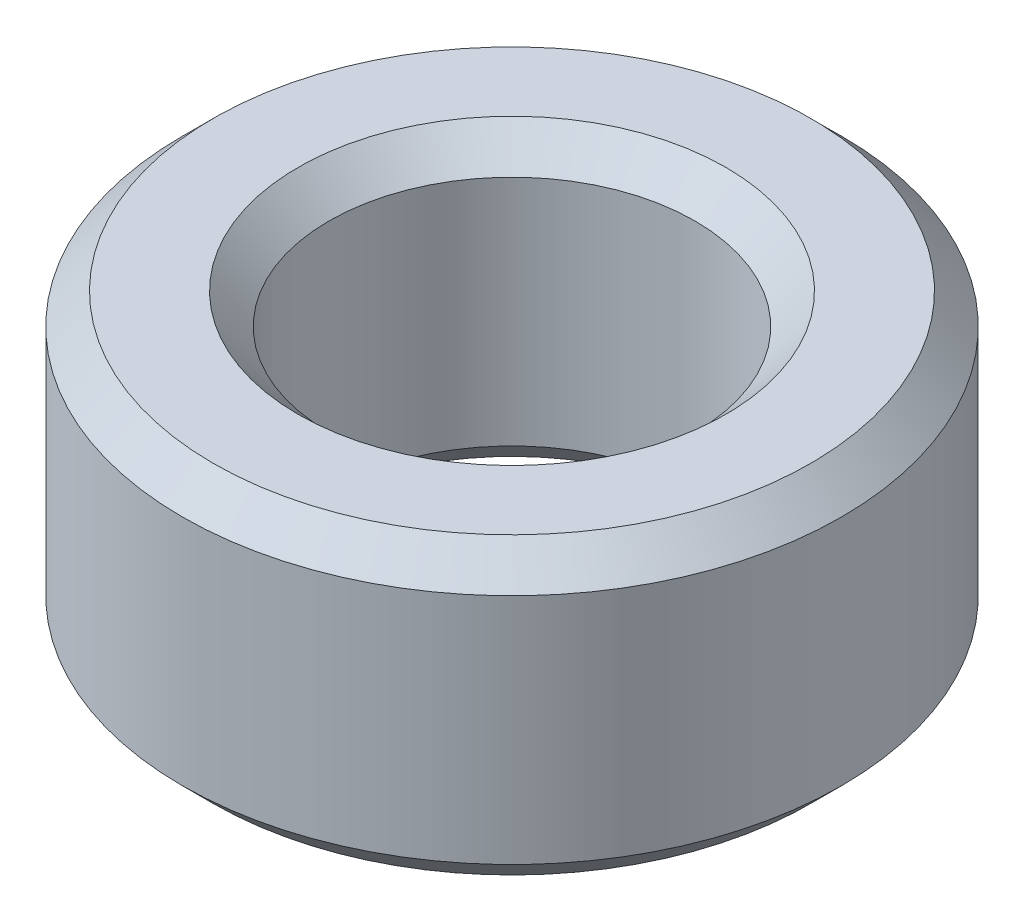
ISO-10303-21;
HEADER;
FILE_DESCRIPTION(('STEP AP214'),'2;1');
FILE_NAME('part.step','',(''),(''),'','','');
FILE_SCHEMA(('AUTOMOTIVE_DESIGN { 1 0 10303 214 1 1 1 1 }'));
ENDSEC;
DATA;
#1=APPLICATION_CONTEXT('core data for automotive mechanical design processes');
#2=APPLICATION_PROTOCOL_DEFINITION('international standard','automotive_design',2000,#1);
#3=PRODUCT_CONTEXT('',#1,'mechanical');
#4=PRODUCT('Part','Part','',(#3));
#5=PRODUCT_RELATED_PRODUCT_CATEGORY('part','',(#4));
#6=PRODUCT_DEFINITION_FORMATION('','',#4);
#7=PRODUCT_DEFINITION_CONTEXT('part definition',#1,'design');
#8=PRODUCT_DEFINITION('design','',#6,#7);
#9=PRODUCT_DEFINITION_SHAPE('','',#8);
#10=(LENGTH_UNIT() NAMED_UNIT(*) SI_UNIT(.MILLI.,.METRE.));
#11=(NAMED_UNIT(*) PLANE_ANGLE_UNIT() SI_UNIT($,.RADIAN.));
#12=(NAMED_UNIT(*) SI_UNIT($,.STERADIAN.) SOLID_ANGLE_UNIT());
#13=UNCERTAINTY_MEASURE_WITH_UNIT(LENGTH_MEASURE(1.E-05),#10,'distance_accuracy_value','');
#14=(GEOMETRIC_REPRESENTATION_CONTEXT(3) GLOBAL_UNCERTAINTY_ASSIGNED_CONTEXT((#13)) GLOBAL_UNIT_ASSIGNED_CONTEXT((#10,
#11,#12)) REPRESENTATION_CONTEXT('',''));
#15=CARTESIAN_POINT('',(0.,0.,0.));
#16=DIRECTION('',(0.,0.,1.));
#17=DIRECTION('',(1.,0.,0.));
#18=AXIS2_PLACEMENT_3D('',#15,#16,#17);
#19=CARTESIAN_POINT('',(0.,24.5735818498043,0.));
#20=DIRECTION('',(0.,-1.,0.));
#21=DIRECTION('',(0.,0.,-1.));
#22=AXIS2_PLACEMENT_3D('',#19,#20,#21);
#23=CYLINDRICAL_SURFACE('',#22,27.5);
#24=CARTESIAN_POINT('',(0.,2.5792470073199,0.));
#25=DIRECTION('',(0.,1.,0.));
#26=DIRECTION('',(0.,0.,1.));
#27=AXIS2_PLACEMENT_3D('',#24,#25,#26);
#28=CIRCLE('',#27,27.5);
#29=CARTESIAN_POINT('',(0.,2.5792470073199,27.5));
#30=VERTEX_POINT('',#29);
#31=EDGE_CURVE('E10',#30,#30,#28,.T.);
#32=ORIENTED_EDGE('',*,*,#31,.T.);
#33=EDGE_LOOP('',(#32));
#34=FACE_BOUND('',#33,.T.);
#35=CARTESIAN_POINT('',(0.,21.9943348424843,0.));
#36=DIRECTION('',(0.,1.,0.));
#37=DIRECTION('',(0.,0.,1.));
#38=AXIS2_PLACEMENT_3D('',#35,#36,#37);
#39=CIRCLE('',#38,27.5);
#40=CARTESIAN_POINT('',(0.,21.9943348424843,27.5));
#41=VERTEX_POINT('',#40);
#42=EDGE_CURVE('E50',#41,#41,#39,.F.);
#43=ORIENTED_EDGE('',*,*,#42,.T.);
#44=EDGE_LOOP('',(#43));
#45=FACE_BOUND('',#44,.T.);
#46=ADVANCED_FACE('F39',(#34,#45),#23,.T.);
#47=CARTESIAN_POINT('',(0.,24.5735818498043,0.));
#48=DIRECTION('',(0.,1.,0.));
#49=DIRECTION('',(0.,0.,1.));
#50=AXIS2_PLACEMENT_3D('',#47,#48,#49);
#51=PLANE('',#50);
#52=CARTESIAN_POINT('',(0.,24.5735818498043,0.));
#53=DIRECTION('',(0.,1.,0.));
#54=DIRECTION('',(0.,0.,1.));
#55=AXIS2_PLACEMENT_3D('',#52,#53,#54);
#56=CIRCLE('',#55,17.8414069667666);
#57=CARTESIAN_POINT('',(0.,24.5735818498043,17.8414069667666));
#58=VERTEX_POINT('',#57);
#59=EDGE_CURVE('E58',#58,#58,#56,.F.);
#60=ORIENTED_EDGE('',*,*,#59,.T.);
#61=EDGE_LOOP('',(#60));
#62=FACE_BOUND('',#61,.T.);
#63=CARTESIAN_POINT('',(0.,24.5735818498043,0.));
#64=DIRECTION('',(0.,1.,0.));
#65=DIRECTION('',(0.,0.,1.));
#66=AXIS2_PLACEMENT_3D('',#63,#64,#65);
#67=CIRCLE('',#66,24.9207529926801);
#68=CARTESIAN_POINT('',(0.,24.5735818498043,24.9207529926801));
#69=VERTEX_POINT('',#68);
#70=EDGE_CURVE('E61',#69,#69,#67,.T.);
#71=ORIENTED_EDGE('',*,*,#70,.T.);
#72=EDGE_LOOP('',(#71));
#73=FACE_BOUND('',#72,.T.);
#74=ADVANCED_FACE('F88',(#62,#73),#51,.T.);
#75=CARTESIAN_POINT('',(0.,0.,0.));
#76=DIRECTION('',(0.,1.,0.));
#77=DIRECTION('',(0.,0.,1.));
#78=AXIS2_PLACEMENT_3D('',#75,#76,#77);
#79=PLANE('',#78);
#80=CARTESIAN_POINT('',(0.,0.,0.));
#81=DIRECTION('',(0.,1.,0.));
#82=DIRECTION('',(0.,0.,1.));
#83=AXIS2_PLACEMENT_3D('',#80,#81,#82);
#84=CIRCLE('',#83,17.8414069667666);
#85=CARTESIAN_POINT('',(0.,0.,17.8414069667666));
#86=VERTEX_POINT('',#85);
#87=EDGE_CURVE('E51',#86,#86,#84,.T.);
#88=ORIENTED_EDGE('',*,*,#87,.T.);
#89=EDGE_LOOP('',(#88));
#90=FACE_BOUND('',#89,.T.);
#91=CARTESIAN_POINT('',(0.,0.,0.));
#92=DIRECTION('',(0.,1.,0.));
#93=DIRECTION('',(0.,0.,1.));
#94=AXIS2_PLACEMENT_3D('',#91,#92,#93);
#95=CIRCLE('',#94,24.9207529926801);
#96=CARTESIAN_POINT('',(0.,0.,24.9207529926801));
#97=VERTEX_POINT('',#96);
#98=EDGE_CURVE('E54',#97,#97,#95,.F.);
#99=ORIENTED_EDGE('',*,*,#98,.T.);
#100=EDGE_LOOP('',(#99));
#101=FACE_BOUND('',#100,.T.);
#102=ADVANCED_FACE('F83',(#90,#101),#79,.F.);
#103=CARTESIAN_POINT('',(0.,24.5735818498043,0.));
#104=DIRECTION('',(0.,-1.,0.));
#105=DIRECTION('',(0.,0.,-1.));
#106=AXIS2_PLACEMENT_3D('',#103,#104,#105);
#107=CYLINDRICAL_SURFACE('',#106,15.2621599594467);
#108=CARTESIAN_POINT('',(0.,21.9943348424844,0.));
#109=DIRECTION('',(0.,1.,0.));
#110=DIRECTION('',(0.,0.,1.));
#111=AXIS2_PLACEMENT_3D('',#108,#109,#110);
#112=CIRCLE('',#111,15.2621599594467);
#113=CARTESIAN_POINT('',(0.,21.9943348424844,15.2621599594467));
#114=VERTEX_POINT('',#113);
#115=EDGE_CURVE('E67',#114,#114,#112,.T.);
#116=ORIENTED_EDGE('',*,*,#115,.T.);
#117=EDGE_LOOP('',(#116));
#118=FACE_BOUND('',#117,.T.);
#119=CARTESIAN_POINT('',(0.,2.57924700731993,0.));
#120=DIRECTION('',(0.,1.,0.));
#121=DIRECTION('',(0.,0.,1.));
#122=AXIS2_PLACEMENT_3D('',#119,#120,#121);
#123=CIRCLE('',#122,15.2621599594467);
#124=CARTESIAN_POINT('',(0.,2.57924700731993,15.2621599594467));
#125=VERTEX_POINT('',#124);
#126=EDGE_CURVE('E69',#125,#125,#123,.F.);
#127=ORIENTED_EDGE('',*,*,#126,.T.);
#128=EDGE_LOOP('',(#127));
#129=FACE_BOUND('',#128,.T.);
#130=ADVANCED_FACE('F71',(#118,#129),#107,.F.);
#131=CARTESIAN_POINT('',(0.,21.9943348424844,0.));
#132=DIRECTION('',(0.,1.,0.));
#133=DIRECTION('',(0.,0.,1.));
#134=AXIS2_PLACEMENT_3D('',#131,#132,#133);
#135=CONICAL_SURFACE('',#134,15.2621599594467,0.785398163397451);
#136=ORIENTED_EDGE('',*,*,#59,.F.);
#137=EDGE_LOOP('',(#136));
#138=FACE_BOUND('',#137,.T.);
#139=ORIENTED_EDGE('',*,*,#115,.F.);
#140=EDGE_LOOP('',(#139));
#141=FACE_BOUND('',#140,.T.);
#142=ADVANCED_FACE('F77',(#138,#141),#135,.F.);
#143=CARTESIAN_POINT('',(0.,0.,0.));
#144=DIRECTION('',(0.,-1.,0.));
#145=DIRECTION('',(0.,0.,-1.));
#146=AXIS2_PLACEMENT_3D('',#143,#144,#145);
#147=CONICAL_SURFACE('',#146,17.8414069667666,0.785398163397445);
#148=ORIENTED_EDGE('',*,*,#126,.F.);
#149=EDGE_LOOP('',(#148));
#150=FACE_BOUND('',#149,.T.);
#151=ORIENTED_EDGE('',*,*,#87,.F.);
#152=EDGE_LOOP('',(#151));
#153=FACE_BOUND('',#152,.T.);
#154=ADVANCED_FACE('F73',(#150,#153),#147,.F.);
#155=CARTESIAN_POINT('',(0.,2.5792470073199,0.));
#156=DIRECTION('',(0.,1.,0.));
#157=DIRECTION('',(0.,0.,1.));
#158=AXIS2_PLACEMENT_3D('',#155,#156,#157);
#159=CONICAL_SURFACE('',#158,27.5,0.785398163397452);
#160=ORIENTED_EDGE('',*,*,#98,.F.);
#161=EDGE_LOOP('',(#160));
#162=FACE_BOUND('',#161,.T.);
#163=ORIENTED_EDGE('',*,*,#31,.F.);
#164=EDGE_LOOP('',(#163));
#165=FACE_BOUND('',#164,.T.);
#166=ADVANCED_FACE('F76',(#162,#165),#159,.T.);
#167=CARTESIAN_POINT('',(0.,24.5735818498043,0.));
#168=DIRECTION('',(0.,-1.,0.));
#169=DIRECTION('',(0.,0.,-1.));
#170=AXIS2_PLACEMENT_3D('',#167,#168,#169);
#171=CONICAL_SURFACE('',#170,24.9207529926801,0.785398163397444);
#172=ORIENTED_EDGE('',*,*,#42,.F.);
#173=EDGE_LOOP('',(#172));
#174=FACE_BOUND('',#173,.T.);
#175=ORIENTED_EDGE('',*,*,#70,.F.);
#176=EDGE_LOOP('',(#175));
#177=FACE_BOUND('',#176,.T.);
#178=ADVANCED_FACE('F45',(#174,#177),#171,.T.);
#179=CLOSED_SHELL('',(#46,#74,#102,#130,#142,#154,#166,#178));
#180=MANIFOLD_SOLID_BREP('B2',#179);
#181=ADVANCED_BREP_SHAPE_REPRESENTATION('',(#18,#180),#14);
#182=SHAPE_DEFINITION_REPRESENTATION(#9,#181);
ENDSEC;
END-ISO-10303-21;
